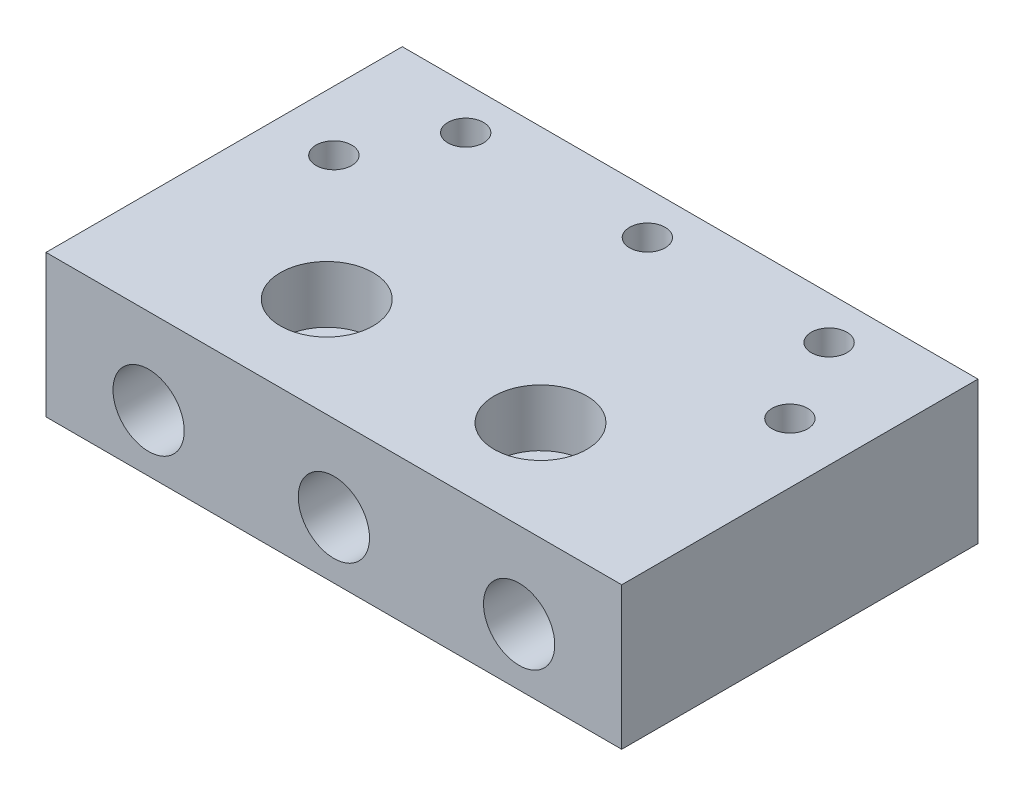
ISO-10303-21;
HEADER;
FILE_DESCRIPTION(('STEP AP214'),'2;1');
FILE_NAME('part.step','',(''),(''),'','','');
FILE_SCHEMA(('AUTOMOTIVE_DESIGN { 1 0 10303 214 1 1 1 1 }'));
ENDSEC;
DATA;
#1=APPLICATION_CONTEXT('core data for automotive mechanical design processes');
#2=APPLICATION_PROTOCOL_DEFINITION('international standard','automotive_design',2000,#1);
#3=PRODUCT_CONTEXT('',#1,'mechanical');
#4=PRODUCT('Part','Part','',(#3));
#5=PRODUCT_RELATED_PRODUCT_CATEGORY('part','',(#4));
#6=PRODUCT_DEFINITION_FORMATION('','',#4);
#7=PRODUCT_DEFINITION_CONTEXT('part definition',#1,'design');
#8=PRODUCT_DEFINITION('design','',#6,#7);
#9=PRODUCT_DEFINITION_SHAPE('','',#8);
#10=(LENGTH_UNIT() NAMED_UNIT(*) SI_UNIT(.MILLI.,.METRE.));
#11=(NAMED_UNIT(*) PLANE_ANGLE_UNIT() SI_UNIT($,.RADIAN.));
#12=(NAMED_UNIT(*) SI_UNIT($,.STERADIAN.) SOLID_ANGLE_UNIT());
#13=UNCERTAINTY_MEASURE_WITH_UNIT(LENGTH_MEASURE(1.E-05),#10,'distance_accuracy_value','');
#14=(GEOMETRIC_REPRESENTATION_CONTEXT(3) GLOBAL_UNCERTAINTY_ASSIGNED_CONTEXT((#13)) GLOBAL_UNIT_ASSIGNED_CONTEXT((#10,
#11,#12)) REPRESENTATION_CONTEXT('',''));
#15=CARTESIAN_POINT('',(0.,0.,0.));
#16=DIRECTION('',(0.,0.,1.));
#17=DIRECTION('',(1.,0.,0.));
#18=AXIS2_PLACEMENT_3D('',#15,#16,#17);
#19=CARTESIAN_POINT('',(-7.5,-4.00000000000001,18.));
#20=DIRECTION('',(0.,1.,0.));
#21=DIRECTION('',(-1.,0.,0.));
#22=AXIS2_PLACEMENT_3D('',#19,#20,#21);
#23=CYLINDRICAL_SURFACE('',#22,1.55);
#24=CARTESIAN_POINT('',(-7.5,-4.00000000000001,18.));
#25=DIRECTION('',(0.,1.,0.));
#26=DIRECTION('',(-1.,0.,0.));
#27=AXIS2_PLACEMENT_3D('',#24,#25,#26);
#28=CIRCLE('',#27,1.55);
#29=CARTESIAN_POINT('',(-9.05,-4.00000000000001,18.));
#30=VERTEX_POINT('',#29);
#31=EDGE_CURVE('E404',#30,#30,#28,.T.);
#32=ORIENTED_EDGE('',*,*,#31,.F.);
#33=EDGE_LOOP('',(#32));
#34=FACE_BOUND('',#33,.T.);
#35=CARTESIAN_POINT('',(-7.5,1.99999999999999,18.));
#36=DIRECTION('',(0.,1.,0.));
#37=DIRECTION('',(-1.,0.,0.));
#38=AXIS2_PLACEMENT_3D('',#35,#36,#37);
#39=CIRCLE('',#38,1.55);
#40=CARTESIAN_POINT('',(-9.05,1.99999999999999,18.));
#41=VERTEX_POINT('',#40);
#42=EDGE_CURVE('E37',#41,#41,#39,.F.);
#43=ORIENTED_EDGE('',*,*,#42,.F.);
#44=EDGE_LOOP('',(#43));
#45=FACE_BOUND('',#44,.T.);
#46=ADVANCED_FACE('F33',(#34,#45),#23,.F.);
#47=CARTESIAN_POINT('',(7.5,-4.00000000000001,18.));
#48=DIRECTION('',(0.,1.,0.));
#49=DIRECTION('',(-1.,0.,0.));
#50=AXIS2_PLACEMENT_3D('',#47,#48,#49);
#51=CYLINDRICAL_SURFACE('',#50,1.55);
#52=CARTESIAN_POINT('',(7.5,-4.00000000000001,18.));
#53=DIRECTION('',(0.,1.,0.));
#54=DIRECTION('',(-1.,0.,0.));
#55=AXIS2_PLACEMENT_3D('',#52,#53,#54);
#56=CIRCLE('',#55,1.55);
#57=CARTESIAN_POINT('',(5.95,-4.00000000000001,18.));
#58=VERTEX_POINT('',#57);
#59=EDGE_CURVE('E401',#58,#58,#56,.T.);
#60=ORIENTED_EDGE('',*,*,#59,.F.);
#61=EDGE_LOOP('',(#60));
#62=FACE_BOUND('',#61,.T.);
#63=CARTESIAN_POINT('',(7.5,2.,18.));
#64=DIRECTION('',(0.,1.,0.));
#65=DIRECTION('',(-1.,0.,0.));
#66=AXIS2_PLACEMENT_3D('',#63,#64,#65);
#67=CIRCLE('',#66,1.55);
#68=CARTESIAN_POINT('',(5.95,2.,18.));
#69=VERTEX_POINT('',#68);
#70=EDGE_CURVE('E203',#69,#69,#67,.F.);
#71=ORIENTED_EDGE('',*,*,#70,.F.);
#72=EDGE_LOOP('',(#71));
#73=FACE_BOUND('',#72,.T.);
#74=ADVANCED_FACE('F90',(#62,#73),#51,.F.);
#75=CARTESIAN_POINT('',(0.,0.,25.));
#76=DIRECTION('',(0.,0.,1.));
#77=DIRECTION('',(1.,0.,0.));
#78=AXIS2_PLACEMENT_3D('',#75,#76,#77);
#79=PLANE('',#78);
#80=CARTESIAN_POINT('',(13.,0.,25.));
#81=DIRECTION('',(0.,0.,1.));
#82=DIRECTION('',(1.,0.,0.));
#83=AXIS2_PLACEMENT_3D('',#80,#81,#82);
#84=CIRCLE('',#83,2.5);
#85=CARTESIAN_POINT('',(15.5,0.,25.));
#86=VERTEX_POINT('',#85);
#87=EDGE_CURVE('E414',#86,#86,#84,.T.);
#88=ORIENTED_EDGE('',*,*,#87,.F.);
#89=EDGE_LOOP('',(#88));
#90=FACE_BOUND('',#89,.T.);
#91=DIRECTION('',(-1.,0.,0.));
#92=VECTOR('',#91,1.);
#93=CARTESIAN_POINT('',(20.2,6.00000000000001,25.));
#94=LINE('',#93,#92);
#95=CARTESIAN_POINT('',(20.2,6.00000000000001,25.));
#96=VERTEX_POINT('',#95);
#97=CARTESIAN_POINT('',(-20.2,5.99999999999999,25.));
#98=VERTEX_POINT('',#97);
#99=EDGE_CURVE('E193',#96,#98,#94,.T.);
#100=ORIENTED_EDGE('',*,*,#99,.T.);
#101=DIRECTION('',(0.,-1.,0.));
#102=VECTOR('',#101,1.);
#103=CARTESIAN_POINT('',(-20.2,5.99999999999999,25.));
#104=LINE('',#103,#102);
#105=CARTESIAN_POINT('',(-20.2,-4.,25.));
#106=VERTEX_POINT('',#105);
#107=EDGE_CURVE('E422',#98,#106,#104,.T.);
#108=ORIENTED_EDGE('',*,*,#107,.T.);
#109=DIRECTION('',(1.,0.,0.));
#110=VECTOR('',#109,1.);
#111=CARTESIAN_POINT('',(-20.2,-4.,25.));
#112=LINE('',#111,#110);
#113=CARTESIAN_POINT('',(20.2,-4.,25.));
#114=VERTEX_POINT('',#113);
#115=EDGE_CURVE('E424',#106,#114,#112,.T.);
#116=ORIENTED_EDGE('',*,*,#115,.T.);
#117=DIRECTION('',(0.,1.,0.));
#118=VECTOR('',#117,1.);
#119=CARTESIAN_POINT('',(20.2,-4.,25.));
#120=LINE('',#119,#118);
#121=EDGE_CURVE('E52',#114,#96,#120,.T.);
#122=ORIENTED_EDGE('',*,*,#121,.T.);
#123=EDGE_LOOP('',(#100,#108,#116,#122));
#124=FACE_BOUND('',#123,.T.);
#125=CARTESIAN_POINT('',(-13.,0.,25.));
#126=DIRECTION('',(0.,0.,1.));
#127=DIRECTION('',(1.,0.,0.));
#128=AXIS2_PLACEMENT_3D('',#125,#126,#127);
#129=CIRCLE('',#128,2.5);
#130=CARTESIAN_POINT('',(-10.5,0.,25.));
#131=VERTEX_POINT('',#130);
#132=EDGE_CURVE('E180',#131,#131,#129,.T.);
#133=ORIENTED_EDGE('',*,*,#132,.F.);
#134=EDGE_LOOP('',(#133));
#135=FACE_BOUND('',#134,.T.);
#136=CARTESIAN_POINT('',(0.,0.,25.));
#137=DIRECTION('',(0.,0.,1.));
#138=DIRECTION('',(1.,0.,0.));
#139=AXIS2_PLACEMENT_3D('',#136,#137,#138);
#140=CIRCLE('',#139,2.5);
#141=CARTESIAN_POINT('',(2.5,0.,25.));
#142=VERTEX_POINT('',#141);
#143=EDGE_CURVE('E408',#142,#142,#140,.T.);
#144=ORIENTED_EDGE('',*,*,#143,.F.);
#145=EDGE_LOOP('',(#144));
#146=FACE_BOUND('',#145,.T.);
#147=ADVANCED_FACE('F96',(#90,#124,#135,#146),#79,.T.);
#148=CARTESIAN_POINT('',(0.,0.,0.));
#149=DIRECTION('',(0.,0.,1.));
#150=DIRECTION('',(1.,0.,0.));
#151=AXIS2_PLACEMENT_3D('',#148,#149,#150);
#152=PLANE('',#151);
#153=CARTESIAN_POINT('',(13.,0.,0.));
#154=DIRECTION('',(0.,0.,1.));
#155=DIRECTION('',(1.,0.,0.));
#156=AXIS2_PLACEMENT_3D('',#153,#154,#155);
#157=CIRCLE('',#156,2.5);
#158=CARTESIAN_POINT('',(15.5,0.,0.));
#159=VERTEX_POINT('',#158);
#160=EDGE_CURVE('E411',#159,#159,#157,.T.);
#161=ORIENTED_EDGE('',*,*,#160,.T.);
#162=EDGE_LOOP('',(#161));
#163=FACE_BOUND('',#162,.T.);
#164=DIRECTION('',(-1.,0.,0.));
#165=VECTOR('',#164,1.);
#166=CARTESIAN_POINT('',(20.2,6.00000000000001,0.));
#167=LINE('',#166,#165);
#168=CARTESIAN_POINT('',(20.2,6.00000000000001,0.));
#169=VERTEX_POINT('',#168);
#170=CARTESIAN_POINT('',(-20.2,5.99999999999999,0.));
#171=VERTEX_POINT('',#170);
#172=EDGE_CURVE('E172',#169,#171,#167,.T.);
#173=ORIENTED_EDGE('',*,*,#172,.F.);
#174=DIRECTION('',(0.,1.,0.));
#175=VECTOR('',#174,1.);
#176=CARTESIAN_POINT('',(20.2,-4.,0.));
#177=LINE('',#176,#175);
#178=CARTESIAN_POINT('',(20.2,-4.,0.));
#179=VERTEX_POINT('',#178);
#180=EDGE_CURVE('E191',#179,#169,#177,.T.);
#181=ORIENTED_EDGE('',*,*,#180,.F.);
#182=DIRECTION('',(1.,0.,0.));
#183=VECTOR('',#182,1.);
#184=CARTESIAN_POINT('',(-20.2,-4.,0.));
#185=LINE('',#184,#183);
#186=CARTESIAN_POINT('',(-20.2,-4.,0.));
#187=VERTEX_POINT('',#186);
#188=EDGE_CURVE('E182',#187,#179,#185,.T.);
#189=ORIENTED_EDGE('',*,*,#188,.F.);
#190=DIRECTION('',(0.,-1.,0.));
#191=VECTOR('',#190,1.);
#192=CARTESIAN_POINT('',(-20.2,5.99999999999999,0.));
#193=LINE('',#192,#191);
#194=EDGE_CURVE('E179',#171,#187,#193,.T.);
#195=ORIENTED_EDGE('',*,*,#194,.F.);
#196=EDGE_LOOP('',(#173,#181,#189,#195));
#197=FACE_BOUND('',#196,.T.);
#198=CARTESIAN_POINT('',(-13.,0.,0.));
#199=DIRECTION('',(0.,0.,1.));
#200=DIRECTION('',(1.,0.,0.));
#201=AXIS2_PLACEMENT_3D('',#198,#199,#200);
#202=CIRCLE('',#201,2.5);
#203=CARTESIAN_POINT('',(-10.5,0.,0.));
#204=VERTEX_POINT('',#203);
#205=EDGE_CURVE('E185',#204,#204,#202,.T.);
#206=ORIENTED_EDGE('',*,*,#205,.T.);
#207=EDGE_LOOP('',(#206));
#208=FACE_BOUND('',#207,.T.);
#209=CARTESIAN_POINT('',(0.,0.,0.));
#210=DIRECTION('',(0.,0.,1.));
#211=DIRECTION('',(1.,0.,0.));
#212=AXIS2_PLACEMENT_3D('',#209,#210,#211);
#213=CIRCLE('',#212,2.5);
#214=CARTESIAN_POINT('',(2.5,0.,0.));
#215=VERTEX_POINT('',#214);
#216=EDGE_CURVE('E407',#215,#215,#213,.T.);
#217=ORIENTED_EDGE('',*,*,#216,.T.);
#218=EDGE_LOOP('',(#217));
#219=FACE_BOUND('',#218,.T.);
#220=ADVANCED_FACE('F119',(#163,#197,#208,#219),#152,.F.);
#221=CARTESIAN_POINT('',(20.2,6.00000000000001,25.));
#222=DIRECTION('',(0.,-1.,0.));
#223=DIRECTION('',(1.,0.,0.));
#224=AXIS2_PLACEMENT_3D('',#221,#222,#223);
#225=PLANE('',#224);
#226=CARTESIAN_POINT('',(-7.5,5.99999999999999,18.));
#227=DIRECTION('',(0.,1.,0.));
#228=DIRECTION('',(-1.,0.,0.));
#229=AXIS2_PLACEMENT_3D('',#226,#227,#228);
#230=CIRCLE('',#229,3.25);
#231=CARTESIAN_POINT('',(-10.75,5.99999999999999,18.));
#232=VERTEX_POINT('',#231);
#233=EDGE_CURVE('E143',#232,#232,#230,.T.);
#234=ORIENTED_EDGE('',*,*,#233,.F.);
#235=EDGE_LOOP('',(#234));
#236=FACE_BOUND('',#235,.T.);
#237=CARTESIAN_POINT('',(7.5,6.,18.));
#238=DIRECTION('',(0.,1.,0.));
#239=DIRECTION('',(-1.,0.,0.));
#240=AXIS2_PLACEMENT_3D('',#237,#238,#239);
#241=CIRCLE('',#240,3.25);
#242=CARTESIAN_POINT('',(4.25,6.,18.));
#243=VERTEX_POINT('',#242);
#244=EDGE_CURVE('E147',#243,#243,#241,.T.);
#245=ORIENTED_EDGE('',*,*,#244,.F.);
#246=EDGE_LOOP('',(#245));
#247=FACE_BOUND('',#246,.T.);
#248=CARTESIAN_POINT('',(16.,6.00000000000001,9.));
#249=DIRECTION('',(0.,1.,0.));
#250=DIRECTION('',(-1.,0.,0.));
#251=AXIS2_PLACEMENT_3D('',#248,#249,#250);
#252=CIRCLE('',#251,1.25);
#253=CARTESIAN_POINT('',(14.75,6.,9.));
#254=VERTEX_POINT('',#253);
#255=EDGE_CURVE('E151',#254,#254,#252,.T.);
#256=ORIENTED_EDGE('',*,*,#255,.F.);
#257=EDGE_LOOP('',(#256));
#258=FACE_BOUND('',#257,.T.);
#259=CARTESIAN_POINT('',(-16.,5.99999999999999,9.));
#260=DIRECTION('',(0.,1.,0.));
#261=DIRECTION('',(-1.,0.,0.));
#262=AXIS2_PLACEMENT_3D('',#259,#260,#261);
#263=CIRCLE('',#262,1.25);
#264=CARTESIAN_POINT('',(-17.25,5.99999999999999,9.));
#265=VERTEX_POINT('',#264);
#266=EDGE_CURVE('E155',#265,#265,#263,.T.);
#267=ORIENTED_EDGE('',*,*,#266,.F.);
#268=EDGE_LOOP('',(#267));
#269=FACE_BOUND('',#268,.T.);
#270=CARTESIAN_POINT('',(12.75,6.,3.));
#271=DIRECTION('',(0.,1.,0.));
#272=DIRECTION('',(-1.,0.,0.));
#273=AXIS2_PLACEMENT_3D('',#270,#271,#272);
#274=CIRCLE('',#273,1.25);
#275=CARTESIAN_POINT('',(11.5,6.,3.));
#276=VERTEX_POINT('',#275);
#277=EDGE_CURVE('E159',#276,#276,#274,.T.);
#278=ORIENTED_EDGE('',*,*,#277,.F.);
#279=EDGE_LOOP('',(#278));
#280=FACE_BOUND('',#279,.T.);
#281=CARTESIAN_POINT('',(-12.75,5.99999999999999,3.));
#282=DIRECTION('',(0.,1.,0.));
#283=DIRECTION('',(-1.,0.,0.));
#284=AXIS2_PLACEMENT_3D('',#281,#282,#283);
#285=CIRCLE('',#284,1.25);
#286=CARTESIAN_POINT('',(-14.,5.99999999999999,3.));
#287=VERTEX_POINT('',#286);
#288=EDGE_CURVE('E163',#287,#287,#285,.T.);
#289=ORIENTED_EDGE('',*,*,#288,.F.);
#290=EDGE_LOOP('',(#289));
#291=FACE_BOUND('',#290,.T.);
#292=CARTESIAN_POINT('',(0.,6.,3.));
#293=DIRECTION('',(0.,1.,0.));
#294=DIRECTION('',(-1.,0.,0.));
#295=AXIS2_PLACEMENT_3D('',#292,#293,#294);
#296=CIRCLE('',#295,1.25);
#297=CARTESIAN_POINT('',(-1.25,6.,3.));
#298=VERTEX_POINT('',#297);
#299=EDGE_CURVE('E167',#298,#298,#296,.T.);
#300=ORIENTED_EDGE('',*,*,#299,.F.);
#301=EDGE_LOOP('',(#300));
#302=FACE_BOUND('',#301,.T.);
#303=ORIENTED_EDGE('',*,*,#172,.T.);
#304=DIRECTION('',(0.,0.,-1.));
#305=VECTOR('',#304,1.);
#306=CARTESIAN_POINT('',(-20.2,5.99999999999999,25.));
#307=LINE('',#306,#305);
#308=EDGE_CURVE('E175',#98,#171,#307,.T.);
#309=ORIENTED_EDGE('',*,*,#308,.F.);
#310=ORIENTED_EDGE('',*,*,#99,.F.);
#311=DIRECTION('',(0.,0.,-1.));
#312=VECTOR('',#311,1.);
#313=CARTESIAN_POINT('',(20.2,6.00000000000001,25.));
#314=LINE('',#313,#312);
#315=EDGE_CURVE('E176',#96,#169,#314,.T.);
#316=ORIENTED_EDGE('',*,*,#315,.T.);
#317=EDGE_LOOP('',(#303,#309,#310,#316));
#318=FACE_BOUND('',#317,.T.);
#319=ADVANCED_FACE('F123',(#236,#247,#258,#269,#280,#291,#302,#318),#225,.F.);
#320=CARTESIAN_POINT('',(-20.2,5.99999999999999,25.));
#321=DIRECTION('',(1.,0.,0.));
#322=DIRECTION('',(0.,0.,-1.));
#323=AXIS2_PLACEMENT_3D('',#320,#321,#322);
#324=PLANE('',#323);
#325=ORIENTED_EDGE('',*,*,#194,.T.);
#326=DIRECTION('',(0.,0.,-1.));
#327=VECTOR('',#326,1.);
#328=CARTESIAN_POINT('',(-20.2,-4.,25.));
#329=LINE('',#328,#327);
#330=EDGE_CURVE('E198',#106,#187,#329,.T.);
#331=ORIENTED_EDGE('',*,*,#330,.F.);
#332=ORIENTED_EDGE('',*,*,#107,.F.);
#333=ORIENTED_EDGE('',*,*,#308,.T.);
#334=EDGE_LOOP('',(#325,#331,#332,#333));
#335=FACE_BOUND('',#334,.T.);
#336=ADVANCED_FACE('F131',(#335),#324,.F.);
#337=CARTESIAN_POINT('',(-20.2,-4.,25.));
#338=DIRECTION('',(0.,1.,0.));
#339=DIRECTION('',(0.,0.,1.));
#340=AXIS2_PLACEMENT_3D('',#337,#338,#339);
#341=PLANE('',#340);
#342=ORIENTED_EDGE('',*,*,#59,.T.);
#343=EDGE_LOOP('',(#342));
#344=FACE_BOUND('',#343,.T.);
#345=ORIENTED_EDGE('',*,*,#31,.T.);
#346=EDGE_LOOP('',(#345));
#347=FACE_BOUND('',#346,.T.);
#348=ORIENTED_EDGE('',*,*,#188,.T.);
#349=DIRECTION('',(0.,0.,-1.));
#350=VECTOR('',#349,1.);
#351=CARTESIAN_POINT('',(20.2,-4.,25.));
#352=LINE('',#351,#350);
#353=EDGE_CURVE('E195',#114,#179,#352,.T.);
#354=ORIENTED_EDGE('',*,*,#353,.F.);
#355=ORIENTED_EDGE('',*,*,#115,.F.);
#356=ORIENTED_EDGE('',*,*,#330,.T.);
#357=EDGE_LOOP('',(#348,#354,#355,#356));
#358=FACE_BOUND('',#357,.T.);
#359=ADVANCED_FACE('F127',(#344,#347,#358),#341,.F.);
#360=CARTESIAN_POINT('',(20.2,-4.,25.));
#361=DIRECTION('',(-1.,0.,0.));
#362=DIRECTION('',(0.,0.,1.));
#363=AXIS2_PLACEMENT_3D('',#360,#361,#362);
#364=PLANE('',#363);
#365=ORIENTED_EDGE('',*,*,#180,.T.);
#366=ORIENTED_EDGE('',*,*,#315,.F.);
#367=ORIENTED_EDGE('',*,*,#121,.F.);
#368=ORIENTED_EDGE('',*,*,#353,.T.);
#369=EDGE_LOOP('',(#365,#366,#367,#368));
#370=FACE_BOUND('',#369,.T.);
#371=ADVANCED_FACE('F115',(#370),#364,.F.);
#372=CARTESIAN_POINT('',(-13.,0.,25.));
#373=DIRECTION('',(0.,0.,-1.));
#374=DIRECTION('',(-1.,0.,0.));
#375=AXIS2_PLACEMENT_3D('',#372,#373,#374);
#376=CYLINDRICAL_SURFACE('',#375,2.5);
#377=CARTESIAN_POINT('',(-14.,2.29128784747792,3.));
#378=CARTESIAN_POINT('',(-13.9999957928934,2.29129265931888,3.06723441826612));
#379=CARTESIAN_POINT('',(-13.9945453066463,2.29369244903522,3.1345486390656));
#380=CARTESIAN_POINT('',(-13.9729631285026,2.30292701826311,3.26720026305788));
#381=CARTESIAN_POINT('',(-13.9568105546368,2.30977046774433,3.33253353987329));
#382=CARTESIAN_POINT('',(-13.9145331709939,2.32683094937621,3.45912863460684));
#383=CARTESIAN_POINT('',(-13.8884456575321,2.33703534521609,3.52040468574306));
#384=CARTESIAN_POINT('',(-13.8271054649872,2.35944039222526,3.6377547262578));
#385=CARTESIAN_POINT('',(-13.7918527271551,2.37164105619047,3.69382868228772));
#386=CARTESIAN_POINT('',(-13.7108869755735,2.39719297268991,3.80251560019912));
#387=CARTESIAN_POINT('',(-13.664712675052,2.4105707990617,3.85477925842088));
#388=CARTESIAN_POINT('',(-13.5641296524399,2.43607201148186,3.95107350597863));
#389=CARTESIAN_POINT('',(-13.5097192637911,2.44819514280703,3.99510242498912));
#390=CARTESIAN_POINT('',(-13.3927232874344,2.46969044088596,4.07447644678771));
#391=CARTESIAN_POINT('',(-13.3299959045948,2.4790027092589,4.10963016537429));
#392=CARTESIAN_POINT('',(-13.1990080721039,2.49293401739394,4.16877954930318));
#393=CARTESIAN_POINT('',(-13.1307515297543,2.49755634069944,4.19278301481351));
#394=CARTESIAN_POINT('',(-12.9962833249023,2.50083237870893,4.22731136690253));
#395=CARTESIAN_POINT('',(-12.9303085710388,2.49991178629397,4.23871969797607));
#396=CARTESIAN_POINT('',(-12.797686836272,2.4926840820669,4.25086221393077));
#397=CARTESIAN_POINT('',(-12.731040052892,2.48637850988761,4.25159944873007));
#398=CARTESIAN_POINT('',(-12.6026196952155,2.46902276768423,4.24286285007708));
#399=CARTESIAN_POINT('',(-12.5407727284255,2.45823584450768,4.23391701803098));
#400=CARTESIAN_POINT('',(-12.4199120835592,2.43255386078125,4.20721778554222));
#401=CARTESIAN_POINT('',(-12.3608989886861,2.41765795883272,4.18946258060234));
#402=CARTESIAN_POINT('',(-12.2438271441547,2.38371905974568,4.14473873204249));
#403=CARTESIAN_POINT('',(-12.1859923724124,2.36449543092113,4.11732397757834));
#404=CARTESIAN_POINT('',(-12.0757865119541,2.32363717796721,4.05449748678223));
#405=CARTESIAN_POINT('',(-12.0234178277176,2.30200150138336,4.01908225261037));
#406=CARTESIAN_POINT('',(-11.9189514784133,2.25499280040206,3.93638275753825));
#407=CARTESIAN_POINT('',(-11.8676369195568,2.2294824496604,3.88818512159194));
#408=CARTESIAN_POINT('',(-11.7735776221794,2.17916033175444,3.78361529489027));
#409=CARTESIAN_POINT('',(-11.7308434880894,2.15434946120973,3.72723313539655));
#410=CARTESIAN_POINT('',(-11.6528564449168,2.10651667024524,3.60366513046178));
#411=CARTESIAN_POINT('',(-11.6181675128377,2.0836768461584,3.53604712047256));
#412=CARTESIAN_POINT('',(-11.5612630744084,2.04480811808694,3.39398392225497));
#413=CARTESIAN_POINT('',(-11.5390179868114,2.02876308394253,3.31955541857824));
#414=CARTESIAN_POINT('',(-11.5108468014798,2.00815504333231,3.17739806914409));
#415=CARTESIAN_POINT('',(-11.5030379827622,2.00227544602284,3.11023903106484));
#416=CARTESIAN_POINT('',(-11.4984274860653,1.998823235033,2.97534843410601));
#417=CARTESIAN_POINT('',(-11.5016168874314,2.00124388901117,2.9076173836507));
#418=CARTESIAN_POINT('',(-11.5173605330203,2.01292005115172,2.7847602884445));
#419=CARTESIAN_POINT('',(-11.5283777186355,2.02105149304479,2.72931495361907));
#420=CARTESIAN_POINT('',(-11.5574578002793,2.0419086812493,2.62121614112832));
#421=CARTESIAN_POINT('',(-11.5755235245654,2.05463627163301,2.56856379380752));
#422=CARTESIAN_POINT('',(-11.6197790561353,2.08464823096067,2.46273046798028));
#423=CARTESIAN_POINT('',(-11.6465148216215,2.10222127676074,2.40986215567617));
#424=CARTESIAN_POINT('',(-11.7066848897158,2.13976507788923,2.30902562243871));
#425=CARTESIAN_POINT('',(-11.7401229488031,2.15973717530331,2.2610601723119));
#426=CARTESIAN_POINT('',(-11.8200758895144,2.20459927475861,2.16182391093681));
#427=CARTESIAN_POINT('',(-11.8678686089474,2.22969982766723,2.11167252706414));
#428=CARTESIAN_POINT('',(-11.9712792569037,2.27925992686294,2.01975309858182));
#429=CARTESIAN_POINT('',(-12.0269029460121,2.30371898540097,1.97799128085446));
#430=CARTESIAN_POINT('',(-12.1494796063429,2.35186265580435,1.90114504780698));
#431=CARTESIAN_POINT('',(-12.21696613109,2.37535632966912,1.86678254410148));
#432=CARTESIAN_POINT('',(-12.3583717450692,2.41738170459281,1.81050352958659));
#433=CARTESIAN_POINT('',(-12.4322847446737,2.43591803669057,1.78857538126794));
#434=CARTESIAN_POINT('',(-12.5769743796174,2.46494780206792,1.7600520632707));
#435=CARTESIAN_POINT('',(-12.6473813708158,2.47603824153209,1.75219761576472));
#436=CARTESIAN_POINT('',(-12.789183603161,2.49211443205575,1.7486073115249));
#437=CARTESIAN_POINT('',(-12.8605781232498,2.49710442172754,1.75286303375684));
#438=CARTESIAN_POINT('',(-12.9944038735139,2.50079715990148,1.77245706466146));
#439=CARTESIAN_POINT('',(-13.056997927581,2.50009725671821,1.78660257135583));
#440=CARTESIAN_POINT('',(-13.1790952758277,2.49432563285411,1.82422041639002));
#441=CARTESIAN_POINT('',(-13.2385984656414,2.48925376465164,1.84769306943803));
#442=CARTESIAN_POINT('',(-13.3533988391002,2.4755764862243,1.90340895082642));
#443=CARTESIAN_POINT('',(-13.4086637818927,2.46694667004182,1.93571222721305));
#444=CARTESIAN_POINT('',(-13.5133526906376,2.44730664333265,2.0081094843396));
#445=CARTESIAN_POINT('',(-13.5627748059377,2.43629568171165,2.04820592290315));
#446=CARTESIAN_POINT('',(-13.6585817889133,2.41224049171482,2.13879717043342));
#447=CARTESIAN_POINT('',(-13.7043964723841,2.39910381371561,2.18987114238249));
#448=CARTESIAN_POINT('',(-13.7871484963748,2.3732429495915,2.29892118149083));
#449=CARTESIAN_POINT('',(-13.8240789679592,2.36051908917479,2.35690253772328));
#450=CARTESIAN_POINT('',(-13.8894803772604,2.33668400401572,2.48113190332034));
#451=CARTESIAN_POINT('',(-13.9175136093307,2.32566696702958,2.54762975110144));
#452=CARTESIAN_POINT('',(-13.9617601422291,2.30772596923535,2.68487006742615));
#453=CARTESIAN_POINT('',(-13.978003732457,2.30079152833904,2.75560114984368));
#454=CARTESIAN_POINT('',(-13.9919972101384,2.29476680467216,2.85584583026083));
#455=CARTESIAN_POINT('',(-13.9949944070331,2.29346700739913,2.88457431908242));
#456=CARTESIAN_POINT('',(-13.9989967331236,2.29172648281368,2.94219695114033));
#457=CARTESIAN_POINT('',(-14.000001808937,2.29128577852219,2.97109109879496));
#458=CARTESIAN_POINT('',(-14.,2.29128784747792,3.));
#459=B_SPLINE_CURVE_WITH_KNOTS('',3,(#377,#378,#379,#380,#381,#382,#383,#384,#385,#386,#387,
#388,#389,#390,#391,#392,#393,#394,#395,#396,#397,#398,#399,#400,#401,#402,#403,#404,#405,#406,
#407,#408,#409,#410,#411,#412,#413,#414,#415,#416,#417,#418,#419,#420,#421,#422,#423,#424,#425,
#426,#427,#428,#429,#430,#431,#432,#433,#434,#435,#436,#437,#438,#439,#440,#441,#442,#443,#444,
#445,#446,#447,#448,#449,#450,#451,#452,#453,#454,#455,#456,#457,#458),.UNSPECIFIED.,.T.,.F.,(4,
2,2,2,2,2,2,2,2,2,2,2,2,2,2,2,2,2,2,2,2,2,2,2,2,2,2,2,2,2,2,2,2,2,2,2,2,2,2,2,4),(0.,
0.201587023476714,0.403568547541919,0.604799179217946,0.806031100815112,1.01810623578155,
1.23022434129346,1.44658676470667,1.66279760283767,1.8626266138446,2.0623985103669,
2.2518015991638,2.44124350100024,2.64092459695744,2.84069316378328,3.06437904973581,
3.2883397070956,3.52504261624147,3.76118042267022,3.96345568680167,4.16556692410218,
4.33617756872412,4.50685674214915,4.69157322184474,4.87639352177538,5.09652586556046,
5.31682099661784,5.55340247795645,5.78976217194583,6.0036561285623,6.21740138634745,
6.40902104554879,6.6006471707573,6.79361023414357,6.9866342536617,7.1952916220352,
7.40410980157954,7.62200860636482,7.83934559471967,7.92601999958655,8.01269672701566),.UNSPECIFIED.);
#460=CARTESIAN_POINT('',(-14.,2.29128784747792,3.));
#461=VERTEX_POINT('',#460);
#462=EDGE_CURVE('E219',#461,#461,#459,.T.);
#463=ORIENTED_EDGE('',*,*,#462,.T.);
#464=EDGE_LOOP('',(#463));
#465=FACE_BOUND('',#464,.T.);
#466=ORIENTED_EDGE('',*,*,#132,.T.);
#467=EDGE_LOOP('',(#466));
#468=FACE_BOUND('',#467,.T.);
#469=ORIENTED_EDGE('',*,*,#205,.F.);
#470=EDGE_LOOP('',(#469));
#471=FACE_BOUND('',#470,.T.);
#472=ADVANCED_FACE('F111',(#465,#468,#471),#376,.F.);
#473=CARTESIAN_POINT('',(13.,0.,25.));
#474=DIRECTION('',(0.,0.,-1.));
#475=DIRECTION('',(-1.,0.,0.));
#476=AXIS2_PLACEMENT_3D('',#473,#474,#475);
#477=CYLINDRICAL_SURFACE('',#476,2.5);
#478=CARTESIAN_POINT('',(11.5,2.,3.));
#479=CARTESIAN_POINT('',(11.5000053181054,2.00000740523235,3.06242858332369));
#480=CARTESIAN_POINT('',(11.5047128970478,2.00356157775744,3.12491134637884));
#481=CARTESIAN_POINT('',(11.5232270300735,2.01724168637216,3.2478071109283));
#482=CARTESIAN_POINT('',(11.5370489763906,2.02737873910955,3.30821642893327));
#483=CARTESIAN_POINT('',(11.5728571868723,2.05273862644511,3.42489447526252));
#484=CARTESIAN_POINT('',(11.5947850497246,2.06792500493631,3.48118945355841));
#485=CARTESIAN_POINT('',(11.6459448686552,2.10177865549331,3.58918370579373));
#486=CARTESIAN_POINT('',(11.6751783247051,2.12044664219683,3.64088203299782));
#487=CARTESIAN_POINT('',(11.7440027518371,2.1620050463518,3.74484500677391));
#488=CARTESIAN_POINT('',(11.7844023133813,2.18513405428499,3.79647814372522));
#489=CARTESIAN_POINT('',(11.8726146446285,2.23192723941984,3.89272685034417));
#490=CARTESIAN_POINT('',(11.9204327124956,2.25559178869749,3.93733735834036));
#491=CARTESIAN_POINT('',(12.0297298484513,2.30491503643615,4.02431530303524));
#492=CARTESIAN_POINT('',(12.0921817678904,2.33041106356298,4.06556496479591));
#493=CARTESIAN_POINT('',(12.224550495123,2.37773185400723,4.13667877025182));
#494=CARTESIAN_POINT('',(12.2944647629588,2.3995578600158,4.16654677220059));
#495=CARTESIAN_POINT('',(12.4361282399936,2.4366205822962,4.21211450889623));
#496=CARTESIAN_POINT('',(12.5075861551708,2.45214413278016,4.2284784623633));
#497=CARTESIAN_POINT('',(12.6533002746915,2.47694183263187,4.24841516005152));
#498=CARTESIAN_POINT('',(12.7275534893123,2.48622246925547,4.25200119901147));
#499=CARTESIAN_POINT('',(12.8670564811207,2.49732404597564,4.24622361518092));
#500=CARTESIAN_POINT('',(12.9323124419717,2.49990944833053,4.23836911081512));
#501=CARTESIAN_POINT('',(13.0607831842392,2.50008578475587,4.2125198511517));
#502=CARTESIAN_POINT('',(13.1239981652839,2.49767720879919,4.19452609077035));
#503=CARTESIAN_POINT('',(13.2446283967812,2.48871604114227,4.14972043062266));
#504=CARTESIAN_POINT('',(13.302162910393,2.48229473545166,4.12320035815026));
#505=CARTESIAN_POINT('',(13.4122566191867,2.46640254138841,4.06201935789729));
#506=CARTESIAN_POINT('',(13.4648146329407,2.45693093120646,4.02735650377406));
#507=CARTESIAN_POINT('',(13.5672835869406,2.43538808097864,3.94816702210012));
#508=CARTESIAN_POINT('',(13.6167719290344,2.42318392058164,3.90313016576299));
#509=CARTESIAN_POINT('',(13.7079006074629,2.39814812318096,3.80583739935752));
#510=CARTESIAN_POINT('',(13.7495366078328,2.38531614440014,3.75357752826764));
#511=CARTESIAN_POINT('',(13.8265964929982,2.35976678154276,3.63915058827431));
#512=CARTESIAN_POINT('',(13.8614046098365,2.34711665331017,3.57655128669605));
#513=CARTESIAN_POINT('',(13.9199606159408,2.32479279868209,3.44588341074321));
#514=CARTESIAN_POINT('',(13.9437129235252,2.3151178838045,3.37781703399201));
#515=CARTESIAN_POINT('',(13.9786543925449,2.30056234328495,3.24035936855571));
#516=CARTESIAN_POINT('',(13.990220984351,2.29553830880356,3.1710800392241));
#517=CARTESIAN_POINT('',(14.0015660878304,2.29061304657583,3.03139759480151));
#518=CARTESIAN_POINT('',(14.0013506415146,2.290709193121,2.96099507421852));
#519=CARTESIAN_POINT('',(13.9896064806785,2.29580267011882,2.82650190760572));
#520=CARTESIAN_POINT('',(13.9788984368485,2.30044445125284,2.76232347277433));
#521=CARTESIAN_POINT('',(13.9478046599131,2.31342758704858,2.63675050753351));
#522=CARTESIAN_POINT('',(13.9274166536077,2.32176981067574,2.57535663475039));
#523=CARTESIAN_POINT('',(13.8770235208246,2.34127596163153,2.45533532566394));
#524=CARTESIAN_POINT('',(13.8467945946886,2.3525041303405,2.39681279906945));
#525=CARTESIAN_POINT('',(13.7776877576208,2.37624381020745,2.28539558707861));
#526=CARTESIAN_POINT('',(13.738806151052,2.38875586849187,2.23250332072944));
#527=CARTESIAN_POINT('',(13.6498994706054,2.41452509598892,2.12956613512447));
#528=CARTESIAN_POINT('',(13.5992448915922,2.42776499605924,2.08005831715006));
#529=CARTESIAN_POINT('',(13.4899907845237,2.45214951568897,1.99008936576446));
#530=CARTESIAN_POINT('',(13.4313912449941,2.46329413222228,1.94962824541892));
#531=CARTESIAN_POINT('',(13.3080718972129,2.48172300409692,1.87925882368435));
#532=CARTESIAN_POINT('',(13.2433925583763,2.48903091263361,1.84928625225154));
#533=CARTESIAN_POINT('',(13.1095523852262,2.49849651991999,1.80071695288528));
#534=CARTESIAN_POINT('',(13.0403949263561,2.50065805245238,1.78211176452802));
#535=CARTESIAN_POINT('',(12.9058118330511,2.49905584810624,1.75802368012442));
#536=CARTESIAN_POINT('',(12.8405505773394,2.49576735682578,1.75158280024662));
#537=CARTESIAN_POINT('',(12.7102965768924,2.48401795197198,1.74893433975373));
#538=CARTESIAN_POINT('',(12.6453038029165,2.47555761746238,1.75272561366115));
#539=CARTESIAN_POINT('',(12.5194692418042,2.45418877914266,1.76985101368318));
#540=CARTESIAN_POINT('',(12.4585612599038,2.44142527498124,1.78288768197886));
#541=CARTESIAN_POINT('',(12.3401869753676,2.41212952531024,1.81747777003784));
#542=CARTESIAN_POINT('',(12.2827213433364,2.39559654846459,1.83903284309947));
#543=CARTESIAN_POINT('',(12.1680927204487,2.3583536275597,1.89177561828132));
#544=CARTESIAN_POINT('',(12.1112814481505,2.33742232174209,1.92356863706395));
#545=CARTESIAN_POINT('',(12.0037215702409,2.29364519988068,1.99513768598371));
#546=CARTESIAN_POINT('',(11.9529781331091,2.27079777950738,2.03492044545224));
#547=CARTESIAN_POINT('',(11.8525680587687,2.2219087432629,2.12690477013205));
#548=CARTESIAN_POINT('',(11.8037659006809,2.19581361555246,2.18002470144557));
#549=CARTESIAN_POINT('',(11.7156487830448,2.14546459347993,2.29443218009404));
#550=CARTESIAN_POINT('',(11.6763324797502,2.12121043866349,2.35571856867414));
#551=CARTESIAN_POINT('',(11.6141245106983,2.08098195276328,2.47463655696366));
#552=CARTESIAN_POINT('',(11.589585802659,2.06430128232745,2.53116611410607));
#553=CARTESIAN_POINT('',(11.5489097109102,2.03591725270707,2.64828732831079));
#554=CARTESIAN_POINT('',(11.5327514960657,2.02420156561751,2.70886848668444));
#555=CARTESIAN_POINT('',(11.5141971240092,2.01058754967136,2.80828199887763));
#556=CARTESIAN_POINT('',(11.5088884246842,2.00664066259366,2.84631284393777));
#557=CARTESIAN_POINT('',(11.5017879440957,2.0013443966354,2.92288884733138));
#558=CARTESIAN_POINT('',(11.4999967146844,1.99999542533975,2.96143408541252));
#559=CARTESIAN_POINT('',(11.5,2.,3.));
#560=B_SPLINE_CURVE_WITH_KNOTS('',3,(#478,#479,#480,#481,#482,#483,#484,#485,#486,#487,#488,
#489,#490,#491,#492,#493,#494,#495,#496,#497,#498,#499,#500,#501,#502,#503,#504,#505,#506,#507,
#508,#509,#510,#511,#512,#513,#514,#515,#516,#517,#518,#519,#520,#521,#522,#523,#524,#525,#526,
#527,#528,#529,#530,#531,#532,#533,#534,#535,#536,#537,#538,#539,#540,#541,#542,#543,#544,#545,
#546,#547,#548,#549,#550,#551,#552,#553,#554,#555,#556,#557,#558,#559),.UNSPECIFIED.,.T.,.F.,(4,
2,2,2,2,2,2,2,2,2,2,2,2,2,2,2,2,2,2,2,2,2,2,2,2,2,2,2,2,2,2,2,2,2,2,2,2,2,2,2,4),(0.,
0.187118698554708,0.37455421300434,0.560664811801824,0.74681365394047,0.954580994289788,
1.1624974072912,1.39851066472445,1.63444384501875,1.85793257351735,2.08118870590163,
2.27752853854445,2.47384910866079,2.6640605646892,2.85431706455054,3.05750263073803,
3.26080006704199,3.4779357511639,3.69498458501012,3.90509312228661,4.11509391367412,
4.30988211860786,4.50471608939221,4.70433294608187,4.90403522510191,5.11919177732671,
5.33434864028829,5.54816301195335,5.76181805311739,5.95780347065827,6.15376694877392,
6.34369592603914,6.53366178387152,6.73799755368439,6.94250615183619,7.17162600705581,
7.4007133865538,7.59149993032904,7.78180994120691,7.89738635598388,8.01298090197518),.UNSPECIFIED.);
#561=CARTESIAN_POINT('',(11.5,2.,3.));
#562=VERTEX_POINT('',#561);
#563=EDGE_CURVE('E217',#562,#562,#560,.T.);
#564=ORIENTED_EDGE('',*,*,#563,.T.);
#565=EDGE_LOOP('',(#564));
#566=FACE_BOUND('',#565,.T.);
#567=ORIENTED_EDGE('',*,*,#87,.T.);
#568=EDGE_LOOP('',(#567));
#569=FACE_BOUND('',#568,.T.);
#570=ORIENTED_EDGE('',*,*,#160,.F.);
#571=EDGE_LOOP('',(#570));
#572=FACE_BOUND('',#571,.T.);
#573=ADVANCED_FACE('F107',(#566,#569,#572),#477,.F.);
#574=CARTESIAN_POINT('',(0.,0.,25.));
#575=DIRECTION('',(0.,0.,-1.));
#576=DIRECTION('',(-1.,0.,0.));
#577=AXIS2_PLACEMENT_3D('',#574,#575,#576);
#578=CYLINDRICAL_SURFACE('',#577,2.5);
#579=CARTESIAN_POINT('',(-1.25,2.1650635094611,3.));
#580=CARTESIAN_POINT('',(-1.24999545384317,2.16506918410574,3.06513476024406));
#581=CARTESIAN_POINT('',(-1.24487496341652,2.16804751484695,3.13035176440631));
#582=CARTESIAN_POINT('',(-1.22465401237257,2.17952958065065,3.25878408084644));
#583=CARTESIAN_POINT('',(-1.20953258069273,2.18804492569449,3.32199489380426));
#584=CARTESIAN_POINT('',(-1.17012493587477,2.20936683256748,3.44431458042993));
#585=CARTESIAN_POINT('',(-1.14588744061717,2.22215054341565,3.50344331559198));
#586=CARTESIAN_POINT('',(-1.08908440672047,2.25053331021072,3.6167802524959));
#587=CARTESIAN_POINT('',(-1.05651841754472,2.26613251845081,3.67098818782807));
#588=CARTESIAN_POINT('',(-0.980833175663601,2.29996086321802,3.77788216069688));
#589=CARTESIAN_POINT('',(-0.937065045179715,2.31830079547442,3.83007391959193));
#590=CARTESIAN_POINT('',(-0.841567259518087,2.35464978482132,3.92676048550839));
#591=CARTESIAN_POINT('',(-0.789833657227868,2.37265867289062,3.9712514532294));
#592=CARTESIAN_POINT('',(-0.675611954268184,2.40776846191186,4.05420893893458));
#593=CARTESIAN_POINT('',(-0.612633986265721,2.42472633022716,4.09206720982441));
#594=CARTESIAN_POINT('',(-0.480196283249382,2.45438445124411,4.1564260665572));
#595=CARTESIAN_POINT('',(-0.410740672672696,2.46708738979677,4.18293382017146));
#596=CARTESIAN_POINT('',(-0.272556179907473,2.48600576555297,4.22188082662637));
#597=CARTESIAN_POINT('',(-0.204127238111024,2.49261850276115,4.23518690794442));
#598=CARTESIAN_POINT('',(-0.0657132858723121,2.50009479807584,4.2502076483438));
#599=CARTESIAN_POINT('',(0.00427075730467112,2.50096183480737,4.25192932099464));
#600=CARTESIAN_POINT('',(0.137290655529685,2.49703727395563,4.24406665753706));
#601=CARTESIAN_POINT('',(0.200401498970987,2.492731198652,4.23545248059847));
#602=CARTESIAN_POINT('',(0.324142214897901,2.47967806574684,4.20889894511918));
#603=CARTESIAN_POINT('',(0.384771901367405,2.47093067582992,4.19095888877972));
#604=CARTESIAN_POINT('',(0.50288673946194,2.44964479109568,4.14614679238773));
#605=CARTESIAN_POINT('',(0.560316779393971,2.43705551911499,4.11915460853492));
#606=CARTESIAN_POINT('',(0.669971001891659,2.40922057483359,4.05717072974813));
#607=CARTESIAN_POINT('',(0.722193311048306,2.39397395196855,4.02217617087206));
#608=CARTESIAN_POINT('',(0.825217076122742,2.36055492999037,3.94138081058373));
#609=CARTESIAN_POINT('',(0.875417593786699,2.34224219997719,3.89487121459249));
#610=CARTESIAN_POINT('',(0.967630462872224,2.30567925733515,3.79426284383728));
#611=CARTESIAN_POINT('',(1.00963651446779,2.28742910332036,3.74015828465742));
#612=CARTESIAN_POINT('',(1.08688166830276,2.25180195115606,3.62168975946989));
#613=CARTESIAN_POINT('',(1.12152164372256,2.23455399988384,3.55689247118224));
#614=CARTESIAN_POINT('',(1.17914889125154,2.2046931284822,3.42132791080125));
#615=CARTESIAN_POINT('',(1.20214832276361,2.19207537557584,3.35056695872805));
#616=CARTESIAN_POINT('',(1.2339752637813,2.17430794771293,3.21098186089651));
#617=CARTESIAN_POINT('',(1.24378140264997,2.1686456981062,3.14244860119556));
#618=CARTESIAN_POINT('',(1.25189618326428,2.16397399202012,3.00449832310432));
#619=CARTESIAN_POINT('',(1.25021294664378,2.16495983611639,2.93508196360027));
#620=CARTESIAN_POINT('',(1.23629505417996,2.17292920675731,2.80543260177659));
#621=CARTESIAN_POINT('',(1.22523477089058,2.17924484383318,2.74502568611509));
#622=CARTESIAN_POINT('',(1.19462035579055,2.19617526939176,2.6270402671613));
#623=CARTESIAN_POINT('',(1.17506347327952,2.20679145006292,2.56946268656674));
#624=CARTESIAN_POINT('',(1.12705948575611,2.23170277599571,2.45573583637163));
#625=CARTESIAN_POINT('',(1.0982425796159,2.24614554053829,2.39977622893306));
#626=CARTESIAN_POINT('',(1.03285883001976,2.27695149371562,2.29316341057626));
#627=CARTESIAN_POINT('',(0.99628800541527,2.29331566693934,2.2425129456084));
#628=CARTESIAN_POINT('',(0.911046458998567,2.3285999807042,2.14127654059556));
#629=CARTESIAN_POINT('',(0.861431590393709,2.34758228942861,2.09150356160293));
#630=CARTESIAN_POINT('',(0.754255619247861,2.38417793722366,2.00073470250801));
#631=CARTESIAN_POINT('',(0.696691843319184,2.40179081259637,1.95974178721182));
#632=CARTESIAN_POINT('',(0.573169203198447,2.43426702113696,1.88678284256237));
#633=CARTESIAN_POINT('',(0.507028871967641,2.44904552090036,1.85508360223636));
#634=CARTESIAN_POINT('',(0.369402955801353,2.47354193699126,1.80357762017826));
#635=CARTESIAN_POINT('',(0.29792212674022,2.48326429595466,1.78376043579212));
#636=CARTESIAN_POINT('',(0.158724602913021,2.49584385227353,1.75828929478167));
#637=CARTESIAN_POINT('',(0.0912643048130706,2.49924909885239,1.75150265515486));
#638=CARTESIAN_POINT('',(-0.0439074824390053,2.50052662968914,1.748945918182));
#639=CARTESIAN_POINT('',(-0.111618875368859,2.49840085083612,1.75317196434554));
#640=CARTESIAN_POINT('',(-0.240672490396434,2.48917461047403,1.77177050849453));
#641=CARTESIAN_POINT('',(-0.30214039726408,2.48241118334987,1.78545606157209));
#642=CARTESIAN_POINT('',(-0.421807440229522,2.46490117079279,1.82165874912871));
#643=CARTESIAN_POINT('',(-0.480006106194387,2.45415401415995,1.84417715011681));
#644=CARTESIAN_POINT('',(-0.594279257806107,2.4290741343515,1.89840881520747));
#645=CARTESIAN_POINT('',(-0.650156428375059,2.41460771498499,1.9304741540098));
#646=CARTESIAN_POINT('',(-0.755968302267532,2.38360166427283,2.00244741357381));
#647=CARTESIAN_POINT('',(-0.805900259268635,2.36706108197951,2.04235893639459));
#648=CARTESIAN_POINT('',(-0.903642505196115,2.33160762783284,2.13349642377838));
#649=CARTESIAN_POINT('',(-0.950747105674091,2.31262248764622,2.18545310934649));
#650=CARTESIAN_POINT('',(-1.03582910924335,2.27578845203565,2.29681340141221));
#651=CARTESIAN_POINT('',(-1.07379843751257,2.25794057202332,2.3562235260846));
#652=CARTESIAN_POINT('',(-1.14053884973207,2.22499506631145,2.48329580822619));
#653=CARTESIAN_POINT('',(-1.16898133245118,2.21000217820338,2.55115941391092));
#654=CARTESIAN_POINT('',(-1.21359838688302,2.18582695410439,2.69166550542472));
#655=CARTESIAN_POINT('',(-1.22981398896918,2.17662520184627,2.76429111114086));
#656=CARTESIAN_POINT('',(-1.24295875983052,2.16911590752238,2.86475669456499));
#657=CARTESIAN_POINT('',(-1.24559513120482,2.1676016125644,2.89170986799735));
#658=CARTESIAN_POINT('',(-1.24911675636246,2.16557419859688,2.9457706008528));
#659=CARTESIAN_POINT('',(-1.25000189299984,2.16506114656387,2.97287817048234));
#660=CARTESIAN_POINT('',(-1.25,2.1650635094611,3.));
#661=B_SPLINE_CURVE_WITH_KNOTS('',3,(#579,#580,#581,#582,#583,#584,#585,#586,#587,#588,#589,
#590,#591,#592,#593,#594,#595,#596,#597,#598,#599,#600,#601,#602,#603,#604,#605,#606,#607,#608,
#609,#610,#611,#612,#613,#614,#615,#616,#617,#618,#619,#620,#621,#622,#623,#624,#625,#626,#627,
#628,#629,#630,#631,#632,#633,#634,#635,#636,#637,#638,#639,#640,#641,#642,#643,#644,#645,#646,
#647,#648,#649,#650,#651,#652,#653,#654,#655,#656,#657,#658,#659,#660),.UNSPECIFIED.,.T.,.F.,(4,
2,2,2,2,2,2,2,2,2,2,2,2,2,2,2,2,2,2,2,2,2,2,2,2,2,2,2,2,2,2,2,2,2,2,2,2,2,2,2,4),(0.,
0.195290153243395,0.390991116031006,0.585660744898607,0.780340906806437,0.991077890622793,
1.20191963855464,1.42697365298454,1.65188533704864,1.86079356209919,2.0695752960755,
2.26020121855673,2.45084140646819,2.64411918413933,2.8374662418784,3.04908989321113,
3.26087560307398,3.48611052161811,3.71110967764631,3.91827863567765,4.12530116485467,
4.30967729280032,4.49411315545079,4.6870912050761,4.88016857775059,5.09758429475767,
5.31507331222753,5.53830226766207,5.76133474760965,5.96390337986859,6.16640108492465,
6.35555531089366,6.54473666890017,6.7420093839934,6.93937287625899,7.15637802312585,
7.37357428556443,7.59763436298257,7.82093916253451,7.90225168981637,7.98356965618176),.UNSPECIFIED.);
#662=CARTESIAN_POINT('',(-1.25,2.1650635094611,3.));
#663=VERTEX_POINT('',#662);
#664=EDGE_CURVE('E395',#663,#663,#661,.T.);
#665=ORIENTED_EDGE('',*,*,#664,.T.);
#666=EDGE_LOOP('',(#665));
#667=FACE_BOUND('',#666,.T.);
#668=ORIENTED_EDGE('',*,*,#143,.T.);
#669=EDGE_LOOP('',(#668));
#670=FACE_BOUND('',#669,.T.);
#671=ORIENTED_EDGE('',*,*,#216,.F.);
#672=EDGE_LOOP('',(#671));
#673=FACE_BOUND('',#672,.T.);
#674=ADVANCED_FACE('F103',(#667,#670,#673),#578,.F.);
#675=CARTESIAN_POINT('',(0.,-4.00100000000002,3.));
#676=DIRECTION('',(0.,1.,0.));
#677=DIRECTION('',(-1.,0.,0.));
#678=AXIS2_PLACEMENT_3D('',#675,#676,#677);
#679=CYLINDRICAL_SURFACE('',#678,1.25);
#680=ORIENTED_EDGE('',*,*,#664,.F.);
#681=EDGE_LOOP('',(#680));
#682=FACE_BOUND('',#681,.T.);
#683=ORIENTED_EDGE('',*,*,#299,.T.);
#684=EDGE_LOOP('',(#683));
#685=FACE_BOUND('',#684,.T.);
#686=ADVANCED_FACE('F106',(#682,#685),#679,.F.);
#687=CARTESIAN_POINT('',(-12.75,-4.00100000000003,3.));
#688=DIRECTION('',(0.,1.,0.));
#689=DIRECTION('',(-1.,0.,0.));
#690=AXIS2_PLACEMENT_3D('',#687,#688,#689);
#691=CYLINDRICAL_SURFACE('',#690,1.25);
#692=ORIENTED_EDGE('',*,*,#462,.F.);
#693=EDGE_LOOP('',(#692));
#694=FACE_BOUND('',#693,.T.);
#695=ORIENTED_EDGE('',*,*,#288,.T.);
#696=EDGE_LOOP('',(#695));
#697=FACE_BOUND('',#696,.T.);
#698=ADVANCED_FACE('F313',(#694,#697),#691,.F.);
#699=CARTESIAN_POINT('',(12.75,-4.00100000000001,3.));
#700=DIRECTION('',(0.,1.,0.));
#701=DIRECTION('',(-1.,0.,0.));
#702=AXIS2_PLACEMENT_3D('',#699,#700,#701);
#703=CYLINDRICAL_SURFACE('',#702,1.25);
#704=ORIENTED_EDGE('',*,*,#563,.F.);
#705=EDGE_LOOP('',(#704));
#706=FACE_BOUND('',#705,.T.);
#707=ORIENTED_EDGE('',*,*,#277,.T.);
#708=EDGE_LOOP('',(#707));
#709=FACE_BOUND('',#708,.T.);
#710=ADVANCED_FACE('F227',(#706,#709),#703,.F.);
#711=CARTESIAN_POINT('',(-16.,1.99999999999999,9.));
#712=DIRECTION('',(0.,1.,0.));
#713=DIRECTION('',(-1.,0.,0.));
#714=AXIS2_PLACEMENT_3D('',#711,#712,#713);
#715=CYLINDRICAL_SURFACE('',#714,1.25);
#716=CARTESIAN_POINT('',(-16.,2.89161633487127,9.));
#717=DIRECTION('',(0.,1.,0.));
#718=DIRECTION('',(-1.,0.,0.));
#719=AXIS2_PLACEMENT_3D('',#716,#717,#718);
#720=CIRCLE('',#719,1.25);
#721=CARTESIAN_POINT('',(-17.25,2.89161633487127,9.));
#722=VERTEX_POINT('',#721);
#723=EDGE_CURVE('E43',#722,#722,#720,.F.);
#724=ORIENTED_EDGE('',*,*,#723,.T.);
#725=EDGE_LOOP('',(#724));
#726=FACE_BOUND('',#725,.T.);
#727=ORIENTED_EDGE('',*,*,#266,.T.);
#728=EDGE_LOOP('',(#727));
#729=FACE_BOUND('',#728,.T.);
#730=ADVANCED_FACE('F232',(#726,#729),#715,.F.);
#731=CARTESIAN_POINT('',(16.,2.00000000000001,9.));
#732=DIRECTION('',(0.,1.,0.));
#733=DIRECTION('',(-1.,0.,0.));
#734=AXIS2_PLACEMENT_3D('',#731,#732,#733);
#735=CYLINDRICAL_SURFACE('',#734,1.25);
#736=CARTESIAN_POINT('',(16.,2.89161633487128,9.));
#737=DIRECTION('',(0.,1.,0.));
#738=DIRECTION('',(-1.,0.,0.));
#739=AXIS2_PLACEMENT_3D('',#736,#737,#738);
#740=CIRCLE('',#739,1.25);
#741=CARTESIAN_POINT('',(14.75,2.89161633487128,9.));
#742=VERTEX_POINT('',#741);
#743=EDGE_CURVE('E11',#742,#742,#740,.F.);
#744=ORIENTED_EDGE('',*,*,#743,.T.);
#745=EDGE_LOOP('',(#744));
#746=FACE_BOUND('',#745,.T.);
#747=ORIENTED_EDGE('',*,*,#255,.T.);
#748=EDGE_LOOP('',(#747));
#749=FACE_BOUND('',#748,.T.);
#750=ADVANCED_FACE('F86',(#746,#749),#735,.F.);
#751=CARTESIAN_POINT('',(-16.,2.89161633487127,9.));
#752=DIRECTION('',(0.,1.,0.));
#753=DIRECTION('',(-1.,0.,0.));
#754=AXIS2_PLACEMENT_3D('',#751,#752,#753);
#755=CONICAL_SURFACE('',#754,1.25000000000002,0.951204442336904);
#756=ORIENTED_EDGE('',*,*,#723,.F.);
#757=EDGE_LOOP('',(#756));
#758=FACE_BOUND('',#757,.T.);
#759=CARTESIAN_POINT('',(-16.,1.99999999999999,9.));
#760=VERTEX_POINT('',#759);
#761=VERTEX_LOOP('',#760);
#762=FACE_BOUND('',#761,.T.);
#763=ADVANCED_FACE('F77',(#758,#762),#755,.F.);
#764=CARTESIAN_POINT('',(16.,2.89161633487128,9.));
#765=DIRECTION('',(0.,1.,0.));
#766=DIRECTION('',(-1.,0.,0.));
#767=AXIS2_PLACEMENT_3D('',#764,#765,#766);
#768=CONICAL_SURFACE('',#767,1.25000000000001,0.951204442336904);
#769=ORIENTED_EDGE('',*,*,#743,.F.);
#770=EDGE_LOOP('',(#769));
#771=FACE_BOUND('',#770,.T.);
#772=CARTESIAN_POINT('',(16.,2.00000000000001,9.));
#773=VERTEX_POINT('',#772);
#774=VERTEX_LOOP('',#773);
#775=FACE_BOUND('',#774,.T.);
#776=ADVANCED_FACE('F35',(#771,#775),#768,.F.);
#777=CARTESIAN_POINT('',(7.5,2.,18.));
#778=DIRECTION('',(0.,1.,0.));
#779=DIRECTION('',(-1.,0.,0.));
#780=AXIS2_PLACEMENT_3D('',#777,#778,#779);
#781=PLANE('',#780);
#782=CARTESIAN_POINT('',(7.5,2.,18.));
#783=DIRECTION('',(0.,1.,0.));
#784=DIRECTION('',(-1.,0.,0.));
#785=AXIS2_PLACEMENT_3D('',#782,#783,#784);
#786=CIRCLE('',#785,3.25);
#787=CARTESIAN_POINT('',(4.25,2.,18.));
#788=VERTEX_POINT('',#787);
#789=EDGE_CURVE('E205',#788,#788,#786,.T.);
#790=ORIENTED_EDGE('',*,*,#789,.T.);
#791=EDGE_LOOP('',(#790));
#792=FACE_BOUND('',#791,.T.);
#793=ORIENTED_EDGE('',*,*,#70,.T.);
#794=EDGE_LOOP('',(#793));
#795=FACE_BOUND('',#794,.T.);
#796=ADVANCED_FACE('F76',(#792,#795),#781,.T.);
#797=CARTESIAN_POINT('',(7.5,2.,18.));
#798=DIRECTION('',(0.,1.,0.));
#799=DIRECTION('',(-1.,0.,0.));
#800=AXIS2_PLACEMENT_3D('',#797,#798,#799);
#801=CYLINDRICAL_SURFACE('',#800,3.25);
#802=ORIENTED_EDGE('',*,*,#789,.F.);
#803=EDGE_LOOP('',(#802));
#804=FACE_BOUND('',#803,.T.);
#805=ORIENTED_EDGE('',*,*,#244,.T.);
#806=EDGE_LOOP('',(#805));
#807=FACE_BOUND('',#806,.T.);
#808=ADVANCED_FACE('F83',(#804,#807),#801,.F.);
#809=CARTESIAN_POINT('',(-7.5,1.99999999999999,18.));
#810=DIRECTION('',(0.,1.,0.));
#811=DIRECTION('',(-1.,0.,0.));
#812=AXIS2_PLACEMENT_3D('',#809,#810,#811);
#813=PLANE('',#812);
#814=CARTESIAN_POINT('',(-7.5,1.99999999999999,18.));
#815=DIRECTION('',(0.,1.,0.));
#816=DIRECTION('',(-1.,0.,0.));
#817=AXIS2_PLACEMENT_3D('',#814,#815,#816);
#818=CIRCLE('',#817,3.25);
#819=CARTESIAN_POINT('',(-10.75,1.99999999999999,18.));
#820=VERTEX_POINT('',#819);
#821=EDGE_CURVE('E254',#820,#820,#818,.T.);
#822=ORIENTED_EDGE('',*,*,#821,.T.);
#823=EDGE_LOOP('',(#822));
#824=FACE_BOUND('',#823,.T.);
#825=ORIENTED_EDGE('',*,*,#42,.T.);
#826=EDGE_LOOP('',(#825));
#827=FACE_BOUND('',#826,.T.);
#828=ADVANCED_FACE('F240',(#824,#827),#813,.T.);
#829=CARTESIAN_POINT('',(-7.5,1.99999999999999,18.));
#830=DIRECTION('',(0.,1.,0.));
#831=DIRECTION('',(-1.,0.,0.));
#832=AXIS2_PLACEMENT_3D('',#829,#830,#831);
#833=CYLINDRICAL_SURFACE('',#832,3.25);
#834=ORIENTED_EDGE('',*,*,#821,.F.);
#835=EDGE_LOOP('',(#834));
#836=FACE_BOUND('',#835,.T.);
#837=ORIENTED_EDGE('',*,*,#233,.T.);
#838=EDGE_LOOP('',(#837));
#839=FACE_BOUND('',#838,.T.);
#840=ADVANCED_FACE('F243',(#836,#839),#833,.F.);
#841=CLOSED_SHELL('',(#46,#74,#147,#220,#319,#336,#359,#371,#472,#573,#674,#686,#698,#710,#730,
#750,#763,#776,#796,#808,#828,#840));
#842=MANIFOLD_SOLID_BREP('B2',#841);
#843=ADVANCED_BREP_SHAPE_REPRESENTATION('',(#18,#842),#14);
#844=SHAPE_DEFINITION_REPRESENTATION(#9,#843);
ENDSEC;
END-ISO-10303-21;
